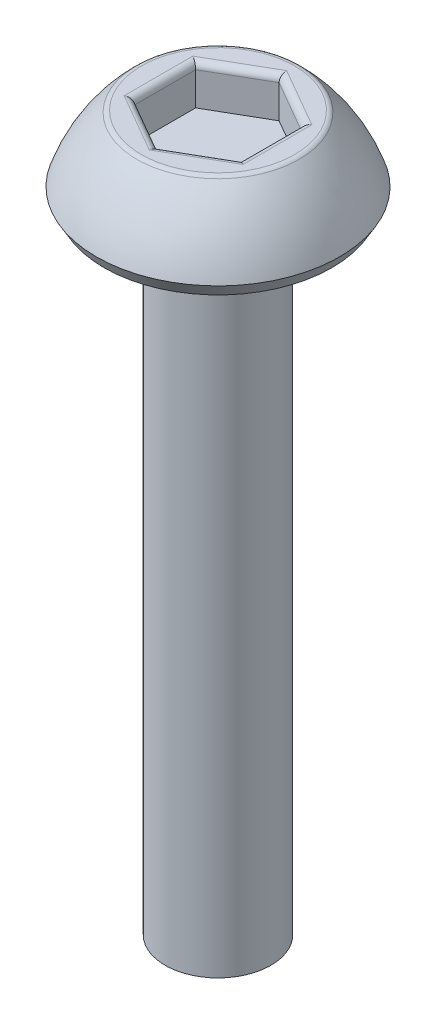
ISO-10303-21;
HEADER;
FILE_DESCRIPTION(('STEP AP214'),'2;1');
FILE_NAME('part.step','',(''),(''),'','','');
FILE_SCHEMA(('AUTOMOTIVE_DESIGN { 1 0 10303 214 1 1 1 1 }'));
ENDSEC;
DATA;
#1=APPLICATION_CONTEXT('core data for automotive mechanical design processes');
#2=APPLICATION_PROTOCOL_DEFINITION('international standard','automotive_design',2000,#1);
#3=PRODUCT_CONTEXT('',#1,'mechanical');
#4=PRODUCT('Part','Part','',(#3));
#5=PRODUCT_RELATED_PRODUCT_CATEGORY('part','',(#4));
#6=PRODUCT_DEFINITION_FORMATION('','',#4);
#7=PRODUCT_DEFINITION_CONTEXT('part definition',#1,'design');
#8=PRODUCT_DEFINITION('design','',#6,#7);
#9=PRODUCT_DEFINITION_SHAPE('','',#8);
#10=(LENGTH_UNIT() NAMED_UNIT(*) SI_UNIT(.MILLI.,.METRE.));
#11=(NAMED_UNIT(*) PLANE_ANGLE_UNIT() SI_UNIT($,.RADIAN.));
#12=(NAMED_UNIT(*) SI_UNIT($,.STERADIAN.) SOLID_ANGLE_UNIT());
#13=UNCERTAINTY_MEASURE_WITH_UNIT(LENGTH_MEASURE(1.E-05),#10,'distance_accuracy_value','');
#14=(GEOMETRIC_REPRESENTATION_CONTEXT(3) GLOBAL_UNCERTAINTY_ASSIGNED_CONTEXT((#13)) GLOBAL_UNIT_ASSIGNED_CONTEXT((#10,
#11,#12)) REPRESENTATION_CONTEXT('',''));
#15=CARTESIAN_POINT('',(0.,0.,0.));
#16=DIRECTION('',(0.,0.,1.));
#17=DIRECTION('',(1.,0.,0.));
#18=AXIS2_PLACEMENT_3D('',#15,#16,#17);
#19=CARTESIAN_POINT('',(0.,1.5,0.));
#20=DIRECTION('',(0.,-1.,0.));
#21=DIRECTION('',(0.,0.,-1.));
#22=AXIS2_PLACEMENT_3D('',#19,#20,#21);
#23=PLANE('',#22);
#24=CARTESIAN_POINT('',(0.,1.5,0.));
#25=DIRECTION('',(0.,-1.,0.));
#26=DIRECTION('',(0.,0.,-1.));
#27=AXIS2_PLACEMENT_3D('',#24,#25,#26);
#28=CIRCLE('',#27,1.45007695941143);
#29=CARTESIAN_POINT('',(0.,1.5,-1.45007695941143));
#30=VERTEX_POINT('',#29);
#31=EDGE_CURVE('E178',#30,#30,#28,.F.);
#32=ORIENTED_EDGE('',*,*,#31,.T.);
#33=EDGE_LOOP('',(#32));
#34=FACE_BOUND('',#33,.T.);
#35=DIRECTION('',(0.866025403784439,0.,-0.5));
#36=VECTOR('',#35,1.);
#37=CARTESIAN_POINT('',(0.5625,1.5,0.974278579257493));
#38=LINE('',#37,#36);
#39=CARTESIAN_POINT('',(1.125,1.5,0.649519052838329));
#40=VERTEX_POINT('',#39);
#41=CARTESIAN_POINT('',(0.,1.5,1.29903810567666));
#42=VERTEX_POINT('',#41);
#43=EDGE_CURVE('E173',#40,#42,#38,.F.);
#44=ORIENTED_EDGE('',*,*,#43,.T.);
#45=DIRECTION('',(0.866025403784439,0.,0.5));
#46=VECTOR('',#45,1.);
#47=CARTESIAN_POINT('',(-0.5625,1.5,0.974278579257493));
#48=LINE('',#47,#46);
#49=CARTESIAN_POINT('',(-1.125,1.5,0.649519052838329));
#50=VERTEX_POINT('',#49);
#51=EDGE_CURVE('E175',#42,#50,#48,.F.);
#52=ORIENTED_EDGE('',*,*,#51,.T.);
#53=DIRECTION('',(0.,0.,1.));
#54=VECTOR('',#53,1.);
#55=CARTESIAN_POINT('',(-1.125,1.5,0.));
#56=LINE('',#55,#54);
#57=CARTESIAN_POINT('',(-1.125,1.5,-0.649519052838329));
#58=VERTEX_POINT('',#57);
#59=EDGE_CURVE('E165',#50,#58,#56,.F.);
#60=ORIENTED_EDGE('',*,*,#59,.T.);
#61=DIRECTION('',(-0.866025403784439,0.,0.5));
#62=VECTOR('',#61,1.);
#63=CARTESIAN_POINT('',(-0.5625,1.5,-0.974278579257493));
#64=LINE('',#63,#62);
#65=CARTESIAN_POINT('',(0.,1.5,-1.29903810567666));
#66=VERTEX_POINT('',#65);
#67=EDGE_CURVE('E167',#58,#66,#64,.F.);
#68=ORIENTED_EDGE('',*,*,#67,.T.);
#69=DIRECTION('',(-0.866025403784439,0.,-0.5));
#70=VECTOR('',#69,1.);
#71=CARTESIAN_POINT('',(0.5625,1.5,-0.974278579257494));
#72=LINE('',#71,#70);
#73=CARTESIAN_POINT('',(1.125,1.5,-0.64951905283833));
#74=VERTEX_POINT('',#73);
#75=EDGE_CURVE('E169',#66,#74,#72,.F.);
#76=ORIENTED_EDGE('',*,*,#75,.T.);
#77=DIRECTION('',(0.,0.,-1.));
#78=VECTOR('',#77,1.);
#79=CARTESIAN_POINT('',(1.125,1.5,0.));
#80=LINE('',#79,#78);
#81=EDGE_CURVE('E171',#74,#40,#80,.F.);
#82=ORIENTED_EDGE('',*,*,#81,.T.);
#83=EDGE_LOOP('',(#44,#52,#60,#68,#76,#82));
#84=FACE_BOUND('',#83,.T.);
#85=ADVANCED_FACE('F36',(#34,#84),#23,.F.);
#86=CARTESIAN_POINT('',(0.,-0.691910970237067,0.));
#87=DIRECTION('',(0.,-1.,0.));
#88=DIRECTION('',(0.,0.,-1.));
#89=AXIS2_PLACEMENT_3D('',#86,#87,#88);
#90=DEGENERATE_TOROIDAL_SURFACE('',#89,0.548298390995416,3.,.F.);
#91=CARTESIAN_POINT('',(0.,1.46486569435813,0.));
#92=DIRECTION('',(0.,-1.,0.));
#93=DIRECTION('',(0.,0.,-1.));
#94=AXIS2_PLACEMENT_3D('',#91,#92,#93);
#95=CIRCLE('',#94,1.53696284421173);
#96=CARTESIAN_POINT('',(0.,1.46486569435813,-1.53696284421173));
#97=VERTEX_POINT('',#96);
#98=EDGE_CURVE('E162',#97,#97,#95,.T.);
#99=ORIENTED_EDGE('',*,*,#98,.T.);
#100=EDGE_LOOP('',(#99));
#101=FACE_BOUND('',#100,.T.);
#102=CARTESIAN_POINT('',(0.,0.25,0.));
#103=DIRECTION('',(0.,-1.,0.));
#104=DIRECTION('',(0.,0.,-1.));
#105=AXIS2_PLACEMENT_3D('',#102,#103,#104);
#106=CIRCLE('',#105,2.3);
#107=CARTESIAN_POINT('',(0.,0.25,-2.3));
#108=VERTEX_POINT('',#107);
#109=EDGE_CURVE('E159',#108,#108,#106,.T.);
#110=ORIENTED_EDGE('',*,*,#109,.F.);
#111=EDGE_LOOP('',(#110));
#112=FACE_BOUND('',#111,.T.);
#113=ADVANCED_FACE('F245',(#101,#112),#90,.F.);
#114=CARTESIAN_POINT('',(0.,0.25,0.));
#115=DIRECTION('',(0.,1.,0.));
#116=DIRECTION('',(0.,0.,1.));
#117=AXIS2_PLACEMENT_3D('',#114,#115,#116);
#118=CONICAL_SURFACE('',#117,2.3,0.523598775598296);
#119=CARTESIAN_POINT('',(0.,0.,0.));
#120=DIRECTION('',(0.,-1.,0.));
#121=DIRECTION('',(0.,0.,-1.));
#122=AXIS2_PLACEMENT_3D('',#119,#120,#121);
#123=CIRCLE('',#122,2.15566243270259);
#124=CARTESIAN_POINT('',(0.,0.,-2.15566243270259));
#125=VERTEX_POINT('',#124);
#126=EDGE_CURVE('E156',#125,#125,#123,.T.);
#127=ORIENTED_EDGE('',*,*,#126,.F.);
#128=EDGE_LOOP('',(#127));
#129=FACE_BOUND('',#128,.T.);
#130=ORIENTED_EDGE('',*,*,#109,.T.);
#131=EDGE_LOOP('',(#130));
#132=FACE_BOUND('',#131,.T.);
#133=ADVANCED_FACE('F251',(#129,#132),#118,.T.);
#134=CARTESIAN_POINT('',(0.,0.,2.15566243270259));
#135=DIRECTION('',(0.,1.,0.));
#136=DIRECTION('',(0.,0.,1.));
#137=AXIS2_PLACEMENT_3D('',#134,#135,#136);
#138=PLANE('',#137);
#139=CARTESIAN_POINT('',(0.,0.,0.));
#140=DIRECTION('',(0.,-1.,0.));
#141=DIRECTION('',(0.,0.,-1.));
#142=AXIS2_PLACEMENT_3D('',#139,#140,#141);
#143=CIRCLE('',#142,1.);
#144=CARTESIAN_POINT('',(0.,0.,-1.));
#145=VERTEX_POINT('',#144);
#146=EDGE_CURVE('E153',#145,#145,#143,.T.);
#147=ORIENTED_EDGE('',*,*,#146,.F.);
#148=EDGE_LOOP('',(#147));
#149=FACE_BOUND('',#148,.T.);
#150=ORIENTED_EDGE('',*,*,#126,.T.);
#151=EDGE_LOOP('',(#150));
#152=FACE_BOUND('',#151,.T.);
#153=ADVANCED_FACE('F270',(#149,#152),#138,.F.);
#154=CARTESIAN_POINT('',(0.,-12.,0.));
#155=DIRECTION('',(0.,-1.,0.));
#156=DIRECTION('',(0.,0.,-1.));
#157=AXIS2_PLACEMENT_3D('',#154,#155,#156);
#158=CYLINDRICAL_SURFACE('',#157,0.999999999999999);
#159=CARTESIAN_POINT('',(0.,-12.,0.));
#160=DIRECTION('',(0.,-1.,0.));
#161=DIRECTION('',(0.,0.,-1.));
#162=AXIS2_PLACEMENT_3D('',#159,#160,#161);
#163=CIRCLE('',#162,0.999999999999999);
#164=CARTESIAN_POINT('',(0.,-12.,-0.999999999999999));
#165=VERTEX_POINT('',#164);
#166=EDGE_CURVE('E140',#165,#165,#163,.T.);
#167=ORIENTED_EDGE('',*,*,#166,.F.);
#168=EDGE_LOOP('',(#167));
#169=FACE_BOUND('',#168,.T.);
#170=ORIENTED_EDGE('',*,*,#146,.T.);
#171=EDGE_LOOP('',(#170));
#172=FACE_BOUND('',#171,.T.);
#173=ADVANCED_FACE('F275',(#169,#172),#158,.T.);
#174=CARTESIAN_POINT('',(0.,-12.,0.999999999999999));
#175=DIRECTION('',(0.,1.,0.));
#176=DIRECTION('',(0.,0.,1.));
#177=AXIS2_PLACEMENT_3D('',#174,#175,#176);
#178=PLANE('',#177);
#179=ORIENTED_EDGE('',*,*,#166,.T.);
#180=EDGE_LOOP('',(#179));
#181=FACE_BOUND('',#180,.T.);
#182=ADVANCED_FACE('F282',(#181),#178,.F.);
#183=CARTESIAN_POINT('',(0.999999999999999,0.75,-0.577350269189626));
#184=DIRECTION('',(0.5,0.,-0.866025403784439));
#185=DIRECTION('',(-0.866025403784439,0.,-0.5));
#186=AXIS2_PLACEMENT_3D('',#183,#184,#185);
#187=PLANE('',#186);
#188=DIRECTION('',(0.,1.,0.));
#189=VECTOR('',#188,1.);
#190=CARTESIAN_POINT('',(0.999999999999999,0.75,-0.577350269189626));
#191=LINE('',#190,#189);
#192=CARTESIAN_POINT('',(0.999999999999999,0.75,-0.577350269189626));
#193=VERTEX_POINT('',#192);
#194=CARTESIAN_POINT('',(0.999999999999999,1.375,-0.577350269189626));
#195=VERTEX_POINT('',#194);
#196=EDGE_CURVE('E138',#193,#195,#191,.T.);
#197=ORIENTED_EDGE('',*,*,#196,.T.);
#198=DIRECTION('',(-0.866025403784439,0.,-0.5));
#199=VECTOR('',#198,1.);
#200=CARTESIAN_POINT('',(0.999999999999999,1.375,-0.577350269189626));
#201=LINE('',#200,#199);
#202=CARTESIAN_POINT('',(0.,1.375,-1.15470053837925));
#203=VERTEX_POINT('',#202);
#204=EDGE_CURVE('E60',#195,#203,#201,.T.);
#205=ORIENTED_EDGE('',*,*,#204,.T.);
#206=DIRECTION('',(0.,1.,0.));
#207=VECTOR('',#206,1.);
#208=CARTESIAN_POINT('',(0.,0.75,-1.15470053837925));
#209=LINE('',#208,#207);
#210=CARTESIAN_POINT('',(0.,0.75,-1.15470053837925));
#211=VERTEX_POINT('',#210);
#212=EDGE_CURVE('E106',#211,#203,#209,.T.);
#213=ORIENTED_EDGE('',*,*,#212,.F.);
#214=DIRECTION('',(-0.866025403784439,0.,-0.5));
#215=VECTOR('',#214,1.);
#216=CARTESIAN_POINT('',(0.999999999999999,0.75,-0.577350269189626));
#217=LINE('',#216,#215);
#218=EDGE_CURVE('E110',#193,#211,#217,.T.);
#219=ORIENTED_EDGE('',*,*,#218,.F.);
#220=EDGE_LOOP('',(#197,#205,#213,#219));
#221=FACE_BOUND('',#220,.T.);
#222=ADVANCED_FACE('F108',(#221),#187,.F.);
#223=CARTESIAN_POINT('',(1.,0.75,0.577350269189626));
#224=DIRECTION('',(1.,0.,0.));
#225=DIRECTION('',(0.,0.,-1.));
#226=AXIS2_PLACEMENT_3D('',#223,#224,#225);
#227=PLANE('',#226);
#228=DIRECTION('',(0.,1.,0.));
#229=VECTOR('',#228,1.);
#230=CARTESIAN_POINT('',(1.,0.75,0.577350269189626));
#231=LINE('',#230,#229);
#232=CARTESIAN_POINT('',(1.,0.75,0.577350269189626));
#233=VERTEX_POINT('',#232);
#234=CARTESIAN_POINT('',(1.,1.375,0.577350269189626));
#235=VERTEX_POINT('',#234);
#236=EDGE_CURVE('E141',#233,#235,#231,.T.);
#237=ORIENTED_EDGE('',*,*,#236,.T.);
#238=DIRECTION('',(0.,0.,-1.));
#239=VECTOR('',#238,1.);
#240=CARTESIAN_POINT('',(1.,1.375,0.577350269189626));
#241=LINE('',#240,#239);
#242=EDGE_CURVE('E186',#235,#195,#241,.T.);
#243=ORIENTED_EDGE('',*,*,#242,.T.);
#244=ORIENTED_EDGE('',*,*,#196,.F.);
#245=DIRECTION('',(0.,0.,-1.));
#246=VECTOR('',#245,1.);
#247=CARTESIAN_POINT('',(1.,0.75,0.577350269189626));
#248=LINE('',#247,#246);
#249=EDGE_CURVE('E114',#233,#193,#248,.T.);
#250=ORIENTED_EDGE('',*,*,#249,.F.);
#251=EDGE_LOOP('',(#237,#243,#244,#250));
#252=FACE_BOUND('',#251,.T.);
#253=ADVANCED_FACE('F226',(#252),#227,.F.);
#254=CARTESIAN_POINT('',(0.,0.75,1.15470053837925));
#255=DIRECTION('',(0.5,0.,0.866025403784439));
#256=DIRECTION('',(0.866025403784439,0.,-0.5));
#257=AXIS2_PLACEMENT_3D('',#254,#255,#256);
#258=PLANE('',#257);
#259=DIRECTION('',(0.,1.,0.));
#260=VECTOR('',#259,1.);
#261=CARTESIAN_POINT('',(0.,0.75,1.15470053837925));
#262=LINE('',#261,#260);
#263=CARTESIAN_POINT('',(0.,0.75,1.15470053837925));
#264=VERTEX_POINT('',#263);
#265=CARTESIAN_POINT('',(0.,1.375,1.15470053837925));
#266=VERTEX_POINT('',#265);
#267=EDGE_CURVE('E144',#264,#266,#262,.T.);
#268=ORIENTED_EDGE('',*,*,#267,.T.);
#269=DIRECTION('',(0.866025403784439,0.,-0.5));
#270=VECTOR('',#269,1.);
#271=CARTESIAN_POINT('',(0.,1.375,1.15470053837925));
#272=LINE('',#271,#270);
#273=EDGE_CURVE('E184',#266,#235,#272,.T.);
#274=ORIENTED_EDGE('',*,*,#273,.T.);
#275=ORIENTED_EDGE('',*,*,#236,.F.);
#276=DIRECTION('',(0.866025403784439,0.,-0.5));
#277=VECTOR('',#276,1.);
#278=CARTESIAN_POINT('',(0.,0.75,1.15470053837925));
#279=LINE('',#278,#277);
#280=EDGE_CURVE('E135',#264,#233,#279,.T.);
#281=ORIENTED_EDGE('',*,*,#280,.F.);
#282=EDGE_LOOP('',(#268,#274,#275,#281));
#283=FACE_BOUND('',#282,.T.);
#284=ADVANCED_FACE('F227',(#283),#258,.F.);
#285=CARTESIAN_POINT('',(-0.999999999999999,0.75,0.577350269189626));
#286=DIRECTION('',(-0.5,0.,0.866025403784439));
#287=DIRECTION('',(0.866025403784439,0.,0.5));
#288=AXIS2_PLACEMENT_3D('',#285,#286,#287);
#289=PLANE('',#288);
#290=DIRECTION('',(0.,1.,0.));
#291=VECTOR('',#290,1.);
#292=CARTESIAN_POINT('',(-0.999999999999999,0.75,0.577350269189626));
#293=LINE('',#292,#291);
#294=CARTESIAN_POINT('',(-0.999999999999999,0.75,0.577350269189626));
#295=VERTEX_POINT('',#294);
#296=CARTESIAN_POINT('',(-0.999999999999999,1.375,0.577350269189626));
#297=VERTEX_POINT('',#296);
#298=EDGE_CURVE('E147',#295,#297,#293,.T.);
#299=ORIENTED_EDGE('',*,*,#298,.T.);
#300=DIRECTION('',(0.866025403784439,0.,0.5));
#301=VECTOR('',#300,1.);
#302=CARTESIAN_POINT('',(-0.999999999999999,1.375,0.577350269189626));
#303=LINE('',#302,#301);
#304=EDGE_CURVE('E181',#297,#266,#303,.T.);
#305=ORIENTED_EDGE('',*,*,#304,.T.);
#306=ORIENTED_EDGE('',*,*,#267,.F.);
#307=DIRECTION('',(0.866025403784439,0.,0.5));
#308=VECTOR('',#307,1.);
#309=CARTESIAN_POINT('',(-0.999999999999999,0.75,0.577350269189626));
#310=LINE('',#309,#308);
#311=EDGE_CURVE('E132',#295,#264,#310,.T.);
#312=ORIENTED_EDGE('',*,*,#311,.F.);
#313=EDGE_LOOP('',(#299,#305,#306,#312));
#314=FACE_BOUND('',#313,.T.);
#315=ADVANCED_FACE('F222',(#314),#289,.F.);
#316=CARTESIAN_POINT('',(-1.,0.75,-0.577350269189626));
#317=DIRECTION('',(-1.,0.,0.));
#318=DIRECTION('',(0.,0.,1.));
#319=AXIS2_PLACEMENT_3D('',#316,#317,#318);
#320=PLANE('',#319);
#321=DIRECTION('',(0.,1.,0.));
#322=VECTOR('',#321,1.);
#323=CARTESIAN_POINT('',(-1.,0.75,-0.577350269189626));
#324=LINE('',#323,#322);
#325=CARTESIAN_POINT('',(-1.,0.75,-0.577350269189626));
#326=VERTEX_POINT('',#325);
#327=CARTESIAN_POINT('',(-1.,1.375,-0.577350269189626));
#328=VERTEX_POINT('',#327);
#329=EDGE_CURVE('E113',#326,#328,#324,.T.);
#330=ORIENTED_EDGE('',*,*,#329,.T.);
#331=DIRECTION('',(0.,0.,1.));
#332=VECTOR('',#331,1.);
#333=CARTESIAN_POINT('',(-1.,1.375,-0.577350269189626));
#334=LINE('',#333,#332);
#335=EDGE_CURVE('E11',#328,#297,#334,.T.);
#336=ORIENTED_EDGE('',*,*,#335,.T.);
#337=ORIENTED_EDGE('',*,*,#298,.F.);
#338=DIRECTION('',(0.,0.,1.));
#339=VECTOR('',#338,1.);
#340=CARTESIAN_POINT('',(-1.,0.75,-0.577350269189626));
#341=LINE('',#340,#339);
#342=EDGE_CURVE('E122',#326,#295,#341,.T.);
#343=ORIENTED_EDGE('',*,*,#342,.F.);
#344=EDGE_LOOP('',(#330,#336,#337,#343));
#345=FACE_BOUND('',#344,.T.);
#346=ADVANCED_FACE('F219',(#345),#320,.F.);
#347=CARTESIAN_POINT('',(0.,0.75,-1.15470053837925));
#348=DIRECTION('',(-0.5,0.,-0.866025403784438));
#349=DIRECTION('',(-0.866025403784439,0.,0.5));
#350=AXIS2_PLACEMENT_3D('',#347,#348,#349);
#351=PLANE('',#350);
#352=ORIENTED_EDGE('',*,*,#212,.T.);
#353=DIRECTION('',(-0.866025403784439,0.,0.5));
#354=VECTOR('',#353,1.);
#355=CARTESIAN_POINT('',(0.,1.375,-1.15470053837925));
#356=LINE('',#355,#354);
#357=EDGE_CURVE('E45',#203,#328,#356,.T.);
#358=ORIENTED_EDGE('',*,*,#357,.T.);
#359=ORIENTED_EDGE('',*,*,#329,.F.);
#360=DIRECTION('',(-0.866025403784439,0.,0.5));
#361=VECTOR('',#360,1.);
#362=CARTESIAN_POINT('',(0.,0.75,-1.15470053837925));
#363=LINE('',#362,#361);
#364=EDGE_CURVE('E117',#211,#326,#363,.T.);
#365=ORIENTED_EDGE('',*,*,#364,.F.);
#366=EDGE_LOOP('',(#352,#358,#359,#365));
#367=FACE_BOUND('',#366,.T.);
#368=ADVANCED_FACE('F118',(#367),#351,.F.);
#369=CARTESIAN_POINT('',(0.,0.75,0.));
#370=DIRECTION('',(0.,1.,0.));
#371=DIRECTION('',(0.,0.,1.));
#372=AXIS2_PLACEMENT_3D('',#369,#370,#371);
#373=PLANE('',#372);
#374=ORIENTED_EDGE('',*,*,#218,.T.);
#375=ORIENTED_EDGE('',*,*,#364,.T.);
#376=ORIENTED_EDGE('',*,*,#342,.T.);
#377=ORIENTED_EDGE('',*,*,#311,.T.);
#378=ORIENTED_EDGE('',*,*,#280,.T.);
#379=ORIENTED_EDGE('',*,*,#249,.T.);
#380=EDGE_LOOP('',(#374,#375,#376,#377,#378,#379));
#381=FACE_BOUND('',#380,.T.);
#382=ADVANCED_FACE('F124',(#381),#373,.T.);
#383=CARTESIAN_POINT('',(0.,1.375,0.));
#384=DIRECTION('',(0.,-1.,0.));
#385=DIRECTION('',(0.,0.,-1.));
#386=AXIS2_PLACEMENT_3D('',#383,#384,#385);
#387=TOROIDAL_SURFACE('',#386,1.45007695941143,0.125);
#388=ORIENTED_EDGE('',*,*,#31,.F.);
#389=EDGE_LOOP('',(#388));
#390=FACE_BOUND('',#389,.T.);
#391=ORIENTED_EDGE('',*,*,#98,.F.);
#392=EDGE_LOOP('',(#391));
#393=FACE_BOUND('',#392,.T.);
#394=ADVANCED_FACE('F255',(#390,#393),#387,.T.);
#395=CARTESIAN_POINT('',(1.0625,1.375,-0.685603444662681));
#396=DIRECTION('',(-0.866025403784439,0.,-0.5));
#397=DIRECTION('',(-0.5,0.,0.866025403784439));
#398=AXIS2_PLACEMENT_3D('',#395,#396,#397);
#399=CYLINDRICAL_SURFACE('',#398,0.125);
#400=CARTESIAN_POINT('',(1.125,1.375,-0.64951905283833));
#401=DIRECTION('',(-0.5,0.,-0.866025403784438));
#402=DIRECTION('',(0.866025403784439,0.,-0.5));
#403=AXIS2_PLACEMENT_3D('',#400,#401,#402);
#404=ELLIPSE('',#403,0.144337567297406,0.125);
#405=EDGE_CURVE('E129',#74,#195,#404,.F.);
#406=ORIENTED_EDGE('',*,*,#405,.F.);
#407=ORIENTED_EDGE('',*,*,#75,.F.);
#408=CARTESIAN_POINT('',(0.,1.375,-1.29903810567666));
#409=DIRECTION('',(-1.,0.,0.));
#410=DIRECTION('',(0.,0.,-1.));
#411=AXIS2_PLACEMENT_3D('',#408,#409,#410);
#412=ELLIPSE('',#411,0.144337567297406,0.125);
#413=EDGE_CURVE('E40',#203,#66,#412,.T.);
#414=ORIENTED_EDGE('',*,*,#413,.F.);
#415=ORIENTED_EDGE('',*,*,#204,.F.);
#416=EDGE_LOOP('',(#406,#407,#414,#415));
#417=FACE_BOUND('',#416,.T.);
#418=ADVANCED_FACE('F38',(#417),#399,.T.);
#419=CARTESIAN_POINT('',(-0.0625000000000002,1.375,-1.26295371385231));
#420=DIRECTION('',(-0.866025403784439,0.,0.5));
#421=DIRECTION('',(0.5,0.,0.866025403784439));
#422=AXIS2_PLACEMENT_3D('',#419,#420,#421);
#423=CYLINDRICAL_SURFACE('',#422,0.125);
#424=ORIENTED_EDGE('',*,*,#413,.T.);
#425=ORIENTED_EDGE('',*,*,#67,.F.);
#426=CARTESIAN_POINT('',(-1.125,1.375,-0.649519052838329));
#427=DIRECTION('',(-0.5,0.,0.866025403784439));
#428=DIRECTION('',(-0.866025403784439,0.,-0.5));
#429=AXIS2_PLACEMENT_3D('',#426,#427,#428);
#430=ELLIPSE('',#429,0.144337567297406,0.125);
#431=EDGE_CURVE('E197',#328,#58,#430,.T.);
#432=ORIENTED_EDGE('',*,*,#431,.F.);
#433=ORIENTED_EDGE('',*,*,#357,.F.);
#434=EDGE_LOOP('',(#424,#425,#432,#433));
#435=FACE_BOUND('',#434,.T.);
#436=ADVANCED_FACE('F211',(#435),#423,.T.);
#437=CARTESIAN_POINT('',(1.125,1.375,0.577350269189626));
#438=DIRECTION('',(0.,0.,-1.));
#439=DIRECTION('',(-1.,0.,0.));
#440=AXIS2_PLACEMENT_3D('',#437,#438,#439);
#441=CYLINDRICAL_SURFACE('',#440,0.125);
#442=ORIENTED_EDGE('',*,*,#405,.T.);
#443=ORIENTED_EDGE('',*,*,#242,.F.);
#444=CARTESIAN_POINT('',(1.125,1.375,0.649519052838329));
#445=DIRECTION('',(0.5,0.,-0.866025403784439));
#446=DIRECTION('',(0.866025403784439,0.,0.5));
#447=AXIS2_PLACEMENT_3D('',#444,#445,#446);
#448=ELLIPSE('',#447,0.144337567297406,0.125);
#449=EDGE_CURVE('E194',#40,#235,#448,.F.);
#450=ORIENTED_EDGE('',*,*,#449,.F.);
#451=ORIENTED_EDGE('',*,*,#81,.F.);
#452=EDGE_LOOP('',(#442,#443,#450,#451));
#453=FACE_BOUND('',#452,.T.);
#454=ADVANCED_FACE('F204',(#453),#441,.T.);
#455=CARTESIAN_POINT('',(-1.125,1.375,-0.577350269189626));
#456=DIRECTION('',(0.,0.,1.));
#457=DIRECTION('',(1.,0.,0.));
#458=AXIS2_PLACEMENT_3D('',#455,#456,#457);
#459=CYLINDRICAL_SURFACE('',#458,0.125);
#460=ORIENTED_EDGE('',*,*,#431,.T.);
#461=ORIENTED_EDGE('',*,*,#59,.F.);
#462=CARTESIAN_POINT('',(-1.125,1.375,0.649519052838329));
#463=DIRECTION('',(0.5,0.,0.866025403784438));
#464=DIRECTION('',(0.866025403784439,0.,-0.5));
#465=AXIS2_PLACEMENT_3D('',#462,#463,#464);
#466=ELLIPSE('',#465,0.144337567297406,0.125);
#467=EDGE_CURVE('E192',#297,#50,#466,.T.);
#468=ORIENTED_EDGE('',*,*,#467,.F.);
#469=ORIENTED_EDGE('',*,*,#335,.F.);
#470=EDGE_LOOP('',(#460,#461,#468,#469));
#471=FACE_BOUND('',#470,.T.);
#472=ADVANCED_FACE('F216',(#471),#459,.T.);
#473=CARTESIAN_POINT('',(0.0625000000000004,1.375,1.26295371385231));
#474=DIRECTION('',(0.866025403784439,0.,-0.5));
#475=DIRECTION('',(-0.5,0.,-0.866025403784439));
#476=AXIS2_PLACEMENT_3D('',#473,#474,#475);
#477=CYLINDRICAL_SURFACE('',#476,0.125);
#478=ORIENTED_EDGE('',*,*,#449,.T.);
#479=ORIENTED_EDGE('',*,*,#273,.F.);
#480=CARTESIAN_POINT('',(0.,1.375,1.29903810567666));
#481=DIRECTION('',(1.,0.,0.));
#482=DIRECTION('',(0.,0.,1.));
#483=AXIS2_PLACEMENT_3D('',#480,#481,#482);
#484=ELLIPSE('',#483,0.144337567297406,0.125);
#485=EDGE_CURVE('E190',#42,#266,#484,.F.);
#486=ORIENTED_EDGE('',*,*,#485,.F.);
#487=ORIENTED_EDGE('',*,*,#43,.F.);
#488=EDGE_LOOP('',(#478,#479,#486,#487));
#489=FACE_BOUND('',#488,.T.);
#490=ADVANCED_FACE('F231',(#489),#477,.T.);
#491=CARTESIAN_POINT('',(-1.0625,1.375,0.685603444662681));
#492=DIRECTION('',(0.866025403784439,0.,0.5));
#493=DIRECTION('',(0.5,0.,-0.866025403784439));
#494=AXIS2_PLACEMENT_3D('',#491,#492,#493);
#495=CYLINDRICAL_SURFACE('',#494,0.125);
#496=ORIENTED_EDGE('',*,*,#467,.T.);
#497=ORIENTED_EDGE('',*,*,#51,.F.);
#498=ORIENTED_EDGE('',*,*,#485,.T.);
#499=ORIENTED_EDGE('',*,*,#304,.F.);
#500=EDGE_LOOP('',(#496,#497,#498,#499));
#501=FACE_BOUND('',#500,.T.);
#502=ADVANCED_FACE('F236',(#501),#495,.T.);
#503=CLOSED_SHELL('',(#85,#113,#133,#153,#173,#182,#222,#253,#284,#315,#346,#368,#382,#394,#418,
#436,#454,#472,#490,#502));
#504=MANIFOLD_SOLID_BREP('B2',#503);
#505=ADVANCED_BREP_SHAPE_REPRESENTATION('',(#18,#504),#14);
#506=SHAPE_DEFINITION_REPRESENTATION(#9,#505);
ENDSEC;
END-ISO-10303-21;
